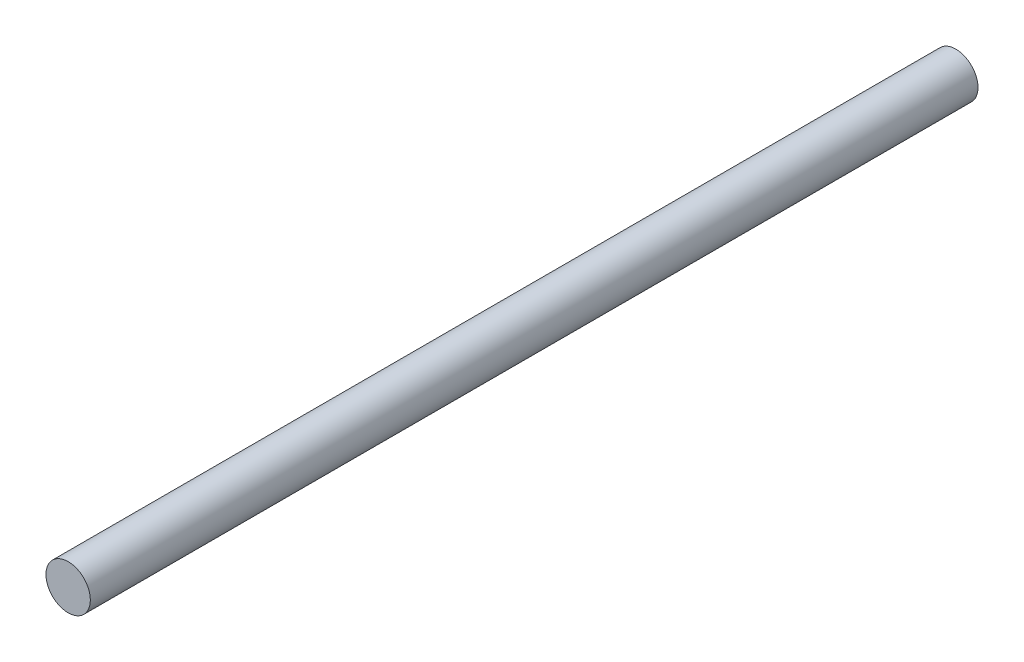
ISO-10303-21;
HEADER;
FILE_DESCRIPTION(('STEP AP214'),'2;1');
FILE_NAME('part.step','',(''),(''),'','','');
FILE_SCHEMA(('AUTOMOTIVE_DESIGN { 1 0 10303 214 1 1 1 1 }'));
ENDSEC;
DATA;
#1=APPLICATION_CONTEXT('core data for automotive mechanical design processes');
#2=APPLICATION_PROTOCOL_DEFINITION('international standard','automotive_design',2000,#1);
#3=PRODUCT_CONTEXT('',#1,'mechanical');
#4=PRODUCT('Part','Part','',(#3));
#5=PRODUCT_RELATED_PRODUCT_CATEGORY('part','',(#4));
#6=PRODUCT_DEFINITION_FORMATION('','',#4);
#7=PRODUCT_DEFINITION_CONTEXT('part definition',#1,'design');
#8=PRODUCT_DEFINITION('design','',#6,#7);
#9=PRODUCT_DEFINITION_SHAPE('','',#8);
#10=(LENGTH_UNIT() NAMED_UNIT(*) SI_UNIT(.MILLI.,.METRE.));
#11=(NAMED_UNIT(*) PLANE_ANGLE_UNIT() SI_UNIT($,.RADIAN.));
#12=(NAMED_UNIT(*) SI_UNIT($,.STERADIAN.) SOLID_ANGLE_UNIT());
#13=UNCERTAINTY_MEASURE_WITH_UNIT(LENGTH_MEASURE(1.E-05),#10,'distance_accuracy_value','');
#14=(GEOMETRIC_REPRESENTATION_CONTEXT(3) GLOBAL_UNCERTAINTY_ASSIGNED_CONTEXT((#13)) GLOBAL_UNIT_ASSIGNED_CONTEXT((#10,
#11,#12)) REPRESENTATION_CONTEXT('',''));
#15=CARTESIAN_POINT('',(0.,0.,0.));
#16=DIRECTION('',(0.,0.,1.));
#17=DIRECTION('',(1.,0.,0.));
#18=AXIS2_PLACEMENT_3D('',#15,#16,#17);
#19=CARTESIAN_POINT('',(0.,0.,31.75));
#20=DIRECTION('',(0.,0.,-1.));
#21=DIRECTION('',(-1.,0.,0.));
#22=AXIS2_PLACEMENT_3D('',#19,#20,#21);
#23=CYLINDRICAL_SURFACE('',#22,0.79375);
#24=CARTESIAN_POINT('',(0.,0.,31.75));
#25=DIRECTION('',(0.,0.,1.));
#26=DIRECTION('',(1.,0.,0.));
#27=AXIS2_PLACEMENT_3D('',#24,#25,#26);
#28=CIRCLE('',#27,0.79375);
#29=CARTESIAN_POINT('',(0.79375,0.,31.75));
#30=VERTEX_POINT('',#29);
#31=EDGE_CURVE('E10',#30,#30,#28,.T.);
#32=ORIENTED_EDGE('',*,*,#31,.F.);
#33=EDGE_LOOP('',(#32));
#34=FACE_BOUND('',#33,.T.);
#35=CARTESIAN_POINT('',(0.,0.,0.));
#36=DIRECTION('',(0.,0.,1.));
#37=DIRECTION('',(1.,0.,0.));
#38=AXIS2_PLACEMENT_3D('',#35,#36,#37);
#39=CIRCLE('',#38,0.79375);
#40=CARTESIAN_POINT('',(0.79375,0.,0.));
#41=VERTEX_POINT('',#40);
#42=EDGE_CURVE('E44',#41,#41,#39,.T.);
#43=ORIENTED_EDGE('',*,*,#42,.T.);
#44=EDGE_LOOP('',(#43));
#45=FACE_BOUND('',#44,.T.);
#46=ADVANCED_FACE('F41',(#34,#45),#23,.T.);
#47=CARTESIAN_POINT('',(0.,0.,31.75));
#48=DIRECTION('',(0.,0.,1.));
#49=DIRECTION('',(1.,0.,0.));
#50=AXIS2_PLACEMENT_3D('',#47,#48,#49);
#51=PLANE('',#50);
#52=ORIENTED_EDGE('',*,*,#31,.T.);
#53=EDGE_LOOP('',(#52));
#54=FACE_BOUND('',#53,.T.);
#55=ADVANCED_FACE('F58',(#54),#51,.T.);
#56=CARTESIAN_POINT('',(0.,0.,0.));
#57=DIRECTION('',(0.,0.,1.));
#58=DIRECTION('',(1.,0.,0.));
#59=AXIS2_PLACEMENT_3D('',#56,#57,#58);
#60=PLANE('',#59);
#61=ORIENTED_EDGE('',*,*,#42,.F.);
#62=EDGE_LOOP('',(#61));
#63=FACE_BOUND('',#62,.T.);
#64=ADVANCED_FACE('F56',(#63),#60,.F.);
#65=CLOSED_SHELL('',(#46,#55,#64));
#66=MANIFOLD_SOLID_BREP('B2',#65);
#67=ADVANCED_BREP_SHAPE_REPRESENTATION('',(#18,#66),#14);
#68=SHAPE_DEFINITION_REPRESENTATION(#9,#67);
ENDSEC;
END-ISO-10303-21;
